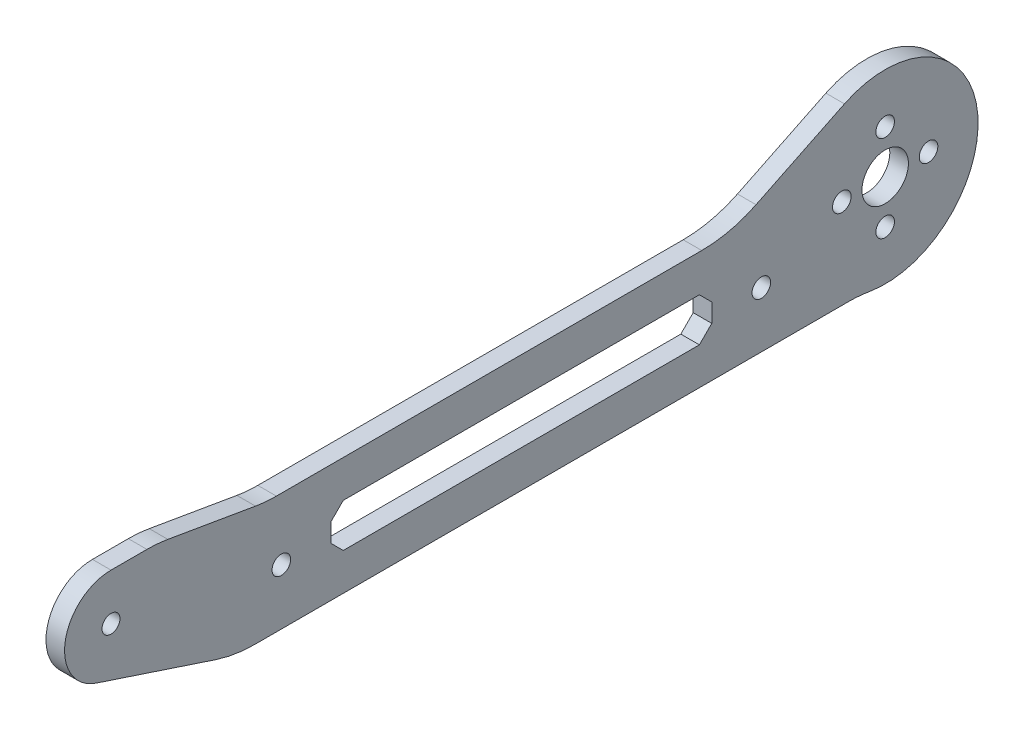
ISO-10303-21;
HEADER;
FILE_DESCRIPTION(('STEP AP214'),'2;1');
FILE_NAME('part.step','',(''),(''),'','','');
FILE_SCHEMA(('AUTOMOTIVE_DESIGN { 1 0 10303 214 1 1 1 1 }'));
ENDSEC;
DATA;
#1=APPLICATION_CONTEXT('core data for automotive mechanical design processes');
#2=APPLICATION_PROTOCOL_DEFINITION('international standard','automotive_design',2000,#1);
#3=PRODUCT_CONTEXT('',#1,'mechanical');
#4=PRODUCT('Part','Part','',(#3));
#5=PRODUCT_RELATED_PRODUCT_CATEGORY('part','',(#4));
#6=PRODUCT_DEFINITION_FORMATION('','',#4);
#7=PRODUCT_DEFINITION_CONTEXT('part definition',#1,'design');
#8=PRODUCT_DEFINITION('design','',#6,#7);
#9=PRODUCT_DEFINITION_SHAPE('','',#8);
#10=(LENGTH_UNIT() NAMED_UNIT(*) SI_UNIT(.MILLI.,.METRE.));
#11=(NAMED_UNIT(*) PLANE_ANGLE_UNIT() SI_UNIT($,.RADIAN.));
#12=(NAMED_UNIT(*) SI_UNIT($,.STERADIAN.) SOLID_ANGLE_UNIT());
#13=UNCERTAINTY_MEASURE_WITH_UNIT(LENGTH_MEASURE(1.E-05),#10,'distance_accuracy_value','');
#14=(GEOMETRIC_REPRESENTATION_CONTEXT(3) GLOBAL_UNCERTAINTY_ASSIGNED_CONTEXT((#13)) GLOBAL_UNIT_ASSIGNED_CONTEXT((#10,
#11,#12)) REPRESENTATION_CONTEXT('',''));
#15=CARTESIAN_POINT('',(0.,0.,0.));
#16=DIRECTION('',(0.,0.,1.));
#17=DIRECTION('',(1.,0.,0.));
#18=AXIS2_PLACEMENT_3D('',#15,#16,#17);
#19=CARTESIAN_POINT('',(1.5,10.75,10.75));
#20=DIRECTION('',(0.,0.707106781186548,0.707106781186547));
#21=DIRECTION('',(0.,-0.707106781186547,0.707106781186548));
#22=AXIS2_PLACEMENT_3D('',#19,#20,#21);
#23=PLANE('',#22);
#24=DIRECTION('',(0.,0.707106781186547,-0.707106781186548));
#25=VECTOR('',#24,1.);
#26=CARTESIAN_POINT('',(-1.5,10.75,10.75));
#27=LINE('',#26,#25);
#28=CARTESIAN_POINT('',(-1.5,-8.50000000000001,30.));
#29=VERTEX_POINT('',#28);
#30=CARTESIAN_POINT('',(-1.5,-6.50000000000001,28.));
#31=VERTEX_POINT('',#30);
#32=EDGE_CURVE('E350',#29,#31,#27,.T.);
#33=ORIENTED_EDGE('',*,*,#32,.F.);
#34=DIRECTION('',(-1.,0.,0.));
#35=VECTOR('',#34,1.);
#36=CARTESIAN_POINT('',(1.5,-8.50000000000001,30.));
#37=LINE('',#36,#35);
#38=CARTESIAN_POINT('',(1.5,-8.50000000000001,30.));
#39=VERTEX_POINT('',#38);
#40=EDGE_CURVE('E217',#39,#29,#37,.T.);
#41=ORIENTED_EDGE('',*,*,#40,.F.);
#42=DIRECTION('',(0.,0.707106781186547,-0.707106781186548));
#43=VECTOR('',#42,1.);
#44=CARTESIAN_POINT('',(1.5,10.75,10.75));
#45=LINE('',#44,#43);
#46=CARTESIAN_POINT('',(1.5,-6.50000000000001,28.));
#47=VERTEX_POINT('',#46);
#48=EDGE_CURVE('E288',#39,#47,#45,.T.);
#49=ORIENTED_EDGE('',*,*,#48,.T.);
#50=DIRECTION('',(-1.,0.,0.));
#51=VECTOR('',#50,1.);
#52=CARTESIAN_POINT('',(1.5,-6.50000000000001,28.));
#53=LINE('',#52,#51);
#54=EDGE_CURVE('E205',#47,#31,#53,.T.);
#55=ORIENTED_EDGE('',*,*,#54,.T.);
#56=EDGE_LOOP('',(#33,#41,#49,#55));
#57=FACE_BOUND('',#56,.T.);
#58=ADVANCED_FACE('F35',(#57),#23,.T.);
#59=CARTESIAN_POINT('',(1.5,-8.50000000000001,0.));
#60=DIRECTION('',(0.,1.,0.));
#61=DIRECTION('',(0.,0.,1.));
#62=AXIS2_PLACEMENT_3D('',#59,#60,#61);
#63=PLANE('',#62);
#64=DIRECTION('',(0.,0.,-1.));
#65=VECTOR('',#64,1.);
#66=CARTESIAN_POINT('',(-1.5,-8.50000000000001,0.));
#67=LINE('',#66,#65);
#68=CARTESIAN_POINT('',(-1.5,-8.50000000000001,87.5));
#69=VERTEX_POINT('',#68);
#70=EDGE_CURVE('E353',#69,#29,#67,.T.);
#71=ORIENTED_EDGE('',*,*,#70,.F.);
#72=DIRECTION('',(-1.,0.,0.));
#73=VECTOR('',#72,1.);
#74=CARTESIAN_POINT('',(1.5,-8.50000000000001,87.5));
#75=LINE('',#74,#73);
#76=CARTESIAN_POINT('',(1.5,-8.50000000000001,87.5));
#77=VERTEX_POINT('',#76);
#78=EDGE_CURVE('E390',#77,#69,#75,.T.);
#79=ORIENTED_EDGE('',*,*,#78,.F.);
#80=DIRECTION('',(0.,0.,-1.));
#81=VECTOR('',#80,1.);
#82=CARTESIAN_POINT('',(1.5,-8.50000000000001,0.));
#83=LINE('',#82,#81);
#84=EDGE_CURVE('E291',#77,#39,#83,.T.);
#85=ORIENTED_EDGE('',*,*,#84,.T.);
#86=ORIENTED_EDGE('',*,*,#40,.T.);
#87=EDGE_LOOP('',(#71,#79,#85,#86));
#88=FACE_BOUND('',#87,.T.);
#89=ADVANCED_FACE('F435',(#88),#63,.T.);
#90=CARTESIAN_POINT('',(1.5,-48.,48.));
#91=DIRECTION('',(0.,0.707106781186548,-0.707106781186547));
#92=DIRECTION('',(0.,0.707106781186547,0.707106781186548));
#93=AXIS2_PLACEMENT_3D('',#90,#91,#92);
#94=PLANE('',#93);
#95=DIRECTION('',(0.,-0.707106781186547,-0.707106781186548));
#96=VECTOR('',#95,1.);
#97=CARTESIAN_POINT('',(-1.5,-48.,48.));
#98=LINE('',#97,#96);
#99=CARTESIAN_POINT('',(-1.5,-6.50000000000001,89.5));
#100=VERTEX_POINT('',#99);
#101=EDGE_CURVE('E356',#100,#69,#98,.T.);
#102=ORIENTED_EDGE('',*,*,#101,.F.);
#103=DIRECTION('',(-1.,0.,0.));
#104=VECTOR('',#103,1.);
#105=CARTESIAN_POINT('',(1.5,-6.50000000000001,89.5));
#106=LINE('',#105,#104);
#107=CARTESIAN_POINT('',(1.5,-6.50000000000001,89.5));
#108=VERTEX_POINT('',#107);
#109=EDGE_CURVE('E388',#108,#100,#106,.T.);
#110=ORIENTED_EDGE('',*,*,#109,.F.);
#111=DIRECTION('',(0.,-0.707106781186547,-0.707106781186548));
#112=VECTOR('',#111,1.);
#113=CARTESIAN_POINT('',(1.5,-48.,48.));
#114=LINE('',#113,#112);
#115=EDGE_CURVE('E294',#108,#77,#114,.T.);
#116=ORIENTED_EDGE('',*,*,#115,.T.);
#117=ORIENTED_EDGE('',*,*,#78,.T.);
#118=EDGE_LOOP('',(#102,#110,#116,#117));
#119=FACE_BOUND('',#118,.T.);
#120=ADVANCED_FACE('F441',(#119),#94,.T.);
#121=CARTESIAN_POINT('',(1.5,0.,89.5));
#122=DIRECTION('',(0.,0.,-1.));
#123=DIRECTION('',(-1.,0.,0.));
#124=AXIS2_PLACEMENT_3D('',#121,#122,#123);
#125=PLANE('',#124);
#126=DIRECTION('',(0.,-1.,0.));
#127=VECTOR('',#126,1.);
#128=CARTESIAN_POINT('',(-1.5,0.,89.5));
#129=LINE('',#128,#127);
#130=CARTESIAN_POINT('',(-1.5,-3.50000000000001,89.5));
#131=VERTEX_POINT('',#130);
#132=EDGE_CURVE('E359',#131,#100,#129,.T.);
#133=ORIENTED_EDGE('',*,*,#132,.F.);
#134=DIRECTION('',(-1.,0.,0.));
#135=VECTOR('',#134,1.);
#136=CARTESIAN_POINT('',(1.5,-3.50000000000001,89.5));
#137=LINE('',#136,#135);
#138=CARTESIAN_POINT('',(1.5,-3.50000000000001,89.5));
#139=VERTEX_POINT('',#138);
#140=EDGE_CURVE('E386',#139,#131,#137,.T.);
#141=ORIENTED_EDGE('',*,*,#140,.F.);
#142=DIRECTION('',(0.,-1.,0.));
#143=VECTOR('',#142,1.);
#144=CARTESIAN_POINT('',(1.5,0.,89.5));
#145=LINE('',#144,#143);
#146=EDGE_CURVE('E297',#139,#108,#145,.T.);
#147=ORIENTED_EDGE('',*,*,#146,.T.);
#148=ORIENTED_EDGE('',*,*,#109,.T.);
#149=EDGE_LOOP('',(#133,#141,#147,#148));
#150=FACE_BOUND('',#149,.T.);
#151=ADVANCED_FACE('F547',(#150),#125,.T.);
#152=CARTESIAN_POINT('',(1.5,43.,43.));
#153=DIRECTION('',(0.,0.707106781186548,0.707106781186547));
#154=DIRECTION('',(0.,-0.707106781186547,0.707106781186548));
#155=AXIS2_PLACEMENT_3D('',#152,#153,#154);
#156=PLANE('',#155);
#157=DIRECTION('',(0.,0.707106781186547,-0.707106781186548));
#158=VECTOR('',#157,1.);
#159=CARTESIAN_POINT('',(-1.5,43.,43.));
#160=LINE('',#159,#158);
#161=CARTESIAN_POINT('',(-1.5,-1.50000000000001,87.5));
#162=VERTEX_POINT('',#161);
#163=EDGE_CURVE('E362',#131,#162,#160,.T.);
#164=ORIENTED_EDGE('',*,*,#163,.T.);
#165=DIRECTION('',(-1.,0.,0.));
#166=VECTOR('',#165,1.);
#167=CARTESIAN_POINT('',(1.5,-1.50000000000001,87.5));
#168=LINE('',#167,#166);
#169=CARTESIAN_POINT('',(1.5,-1.50000000000001,87.5));
#170=VERTEX_POINT('',#169);
#171=EDGE_CURVE('E383',#170,#162,#168,.T.);
#172=ORIENTED_EDGE('',*,*,#171,.F.);
#173=DIRECTION('',(0.,0.707106781186547,-0.707106781186548));
#174=VECTOR('',#173,1.);
#175=CARTESIAN_POINT('',(1.5,43.,43.));
#176=LINE('',#175,#174);
#177=EDGE_CURVE('E300',#139,#170,#176,.T.);
#178=ORIENTED_EDGE('',*,*,#177,.F.);
#179=ORIENTED_EDGE('',*,*,#140,.T.);
#180=EDGE_LOOP('',(#164,#172,#178,#179));
#181=FACE_BOUND('',#180,.T.);
#182=ADVANCED_FACE('F543',(#181),#156,.F.);
#183=CARTESIAN_POINT('',(1.5,-1.50000000000001,0.));
#184=DIRECTION('',(0.,1.,0.));
#185=DIRECTION('',(0.,0.,1.));
#186=AXIS2_PLACEMENT_3D('',#183,#184,#185);
#187=PLANE('',#186);
#188=DIRECTION('',(0.,0.,-1.));
#189=VECTOR('',#188,1.);
#190=CARTESIAN_POINT('',(-1.5,-1.50000000000001,0.));
#191=LINE('',#190,#189);
#192=CARTESIAN_POINT('',(-1.5,-1.50000000000001,30.));
#193=VERTEX_POINT('',#192);
#194=EDGE_CURVE('E365',#162,#193,#191,.T.);
#195=ORIENTED_EDGE('',*,*,#194,.T.);
#196=DIRECTION('',(-1.,0.,0.));
#197=VECTOR('',#196,1.);
#198=CARTESIAN_POINT('',(1.5,-1.50000000000001,30.));
#199=LINE('',#198,#197);
#200=CARTESIAN_POINT('',(1.5,-1.50000000000001,30.));
#201=VERTEX_POINT('',#200);
#202=EDGE_CURVE('E380',#201,#193,#199,.T.);
#203=ORIENTED_EDGE('',*,*,#202,.F.);
#204=DIRECTION('',(0.,0.,-1.));
#205=VECTOR('',#204,1.);
#206=CARTESIAN_POINT('',(1.5,-1.50000000000001,0.));
#207=LINE('',#206,#205);
#208=EDGE_CURVE('E303',#170,#201,#207,.T.);
#209=ORIENTED_EDGE('',*,*,#208,.F.);
#210=ORIENTED_EDGE('',*,*,#171,.T.);
#211=EDGE_LOOP('',(#195,#203,#209,#210));
#212=FACE_BOUND('',#211,.T.);
#213=ADVANCED_FACE('F539',(#212),#187,.F.);
#214=CARTESIAN_POINT('',(1.5,-15.75,15.75));
#215=DIRECTION('',(0.,0.707106781186548,-0.707106781186547));
#216=DIRECTION('',(0.,0.707106781186547,0.707106781186548));
#217=AXIS2_PLACEMENT_3D('',#214,#215,#216);
#218=PLANE('',#217);
#219=DIRECTION('',(0.,-0.707106781186547,-0.707106781186548));
#220=VECTOR('',#219,1.);
#221=CARTESIAN_POINT('',(-1.5,-15.75,15.75));
#222=LINE('',#221,#220);
#223=CARTESIAN_POINT('',(-1.5,-3.50000000000001,28.));
#224=VERTEX_POINT('',#223);
#225=EDGE_CURVE('E368',#193,#224,#222,.T.);
#226=ORIENTED_EDGE('',*,*,#225,.T.);
#227=DIRECTION('',(-1.,0.,0.));
#228=VECTOR('',#227,1.);
#229=CARTESIAN_POINT('',(1.5,-3.50000000000001,28.));
#230=LINE('',#229,#228);
#231=CARTESIAN_POINT('',(1.5,-3.50000000000001,28.));
#232=VERTEX_POINT('',#231);
#233=EDGE_CURVE('E208',#232,#224,#230,.T.);
#234=ORIENTED_EDGE('',*,*,#233,.F.);
#235=DIRECTION('',(0.,-0.707106781186547,-0.707106781186548));
#236=VECTOR('',#235,1.);
#237=CARTESIAN_POINT('',(1.5,-15.75,15.75));
#238=LINE('',#237,#236);
#239=EDGE_CURVE('E306',#201,#232,#238,.T.);
#240=ORIENTED_EDGE('',*,*,#239,.F.);
#241=ORIENTED_EDGE('',*,*,#202,.T.);
#242=EDGE_LOOP('',(#226,#234,#240,#241));
#243=FACE_BOUND('',#242,.T.);
#244=ADVANCED_FACE('F473',(#243),#218,.F.);
#245=CARTESIAN_POINT('',(1.5,0.,0.));
#246=DIRECTION('',(-1.,0.,0.));
#247=DIRECTION('',(0.,0.,1.));
#248=AXIS2_PLACEMENT_3D('',#245,#246,#247);
#249=CYLINDRICAL_SURFACE('',#248,15.);
#250=CARTESIAN_POINT('',(1.5,0.,0.));
#251=DIRECTION('',(1.,0.,0.));
#252=DIRECTION('',(0.,0.,-1.));
#253=AXIS2_PLACEMENT_3D('',#250,#251,#252);
#254=CIRCLE('',#253,15.);
#255=CARTESIAN_POINT('',(1.5,-14.7857142857143,2.52639131197534));
#256=VERTEX_POINT('',#255);
#257=CARTESIAN_POINT('',(1.5,13.4831460674157,6.57303370786517));
#258=VERTEX_POINT('',#257);
#259=EDGE_CURVE('E187',#256,#258,#254,.T.);
#260=ORIENTED_EDGE('',*,*,#259,.F.);
#261=DIRECTION('',(-1.,0.,0.));
#262=VECTOR('',#261,1.);
#263=CARTESIAN_POINT('',(1.5,-14.7857142857143,2.52639131197534));
#264=LINE('',#263,#262);
#265=CARTESIAN_POINT('',(-1.5,-14.7857142857143,2.52639131197534));
#266=VERTEX_POINT('',#265);
#267=EDGE_CURVE('E214',#256,#266,#264,.T.);
#268=ORIENTED_EDGE('',*,*,#267,.T.);
#269=CARTESIAN_POINT('',(-1.5,0.,0.));
#270=DIRECTION('',(1.,0.,0.));
#271=DIRECTION('',(0.,0.,-1.));
#272=AXIS2_PLACEMENT_3D('',#269,#270,#271);
#273=CIRCLE('',#272,15.);
#274=CARTESIAN_POINT('',(-1.5,13.4831460674157,6.57303370786517));
#275=VERTEX_POINT('',#274);
#276=EDGE_CURVE('E204',#266,#275,#273,.T.);
#277=ORIENTED_EDGE('',*,*,#276,.T.);
#278=DIRECTION('',(-1.,0.,0.));
#279=VECTOR('',#278,1.);
#280=CARTESIAN_POINT('',(1.5,13.4831460674157,6.57303370786517));
#281=LINE('',#280,#279);
#282=EDGE_CURVE('E183',#258,#275,#281,.T.);
#283=ORIENTED_EDGE('',*,*,#282,.F.);
#284=EDGE_LOOP('',(#260,#268,#277,#283));
#285=FACE_BOUND('',#284,.T.);
#286=ADVANCED_FACE('F202',(#285),#249,.T.);
#287=CARTESIAN_POINT('',(1.5,13.4831460674157,6.57303370786516));
#288=DIRECTION('',(0.,0.898876404494382,0.438202247191011));
#289=DIRECTION('',(0.,-0.438202247191011,0.898876404494382));
#290=AXIS2_PLACEMENT_3D('',#287,#288,#289);
#291=PLANE('',#290);
#292=DIRECTION('',(0.,0.438202247191011,-0.898876404494382));
#293=VECTOR('',#292,1.);
#294=CARTESIAN_POINT('',(-1.5,13.4831460674157,6.57303370786516));
#295=LINE('',#294,#293);
#296=CARTESIAN_POINT('',(-1.5,6.52247191011237,20.8513396715644));
#297=VERTEX_POINT('',#296);
#298=EDGE_CURVE('E256',#297,#275,#295,.T.);
#299=ORIENTED_EDGE('',*,*,#298,.F.);
#300=DIRECTION('',(-1.,0.,0.));
#301=VECTOR('',#300,1.);
#302=CARTESIAN_POINT('',(1.5,6.52247191011237,20.8513396715644));
#303=LINE('',#302,#301);
#304=CARTESIAN_POINT('',(1.5,6.52247191011237,20.8513396715644));
#305=VERTEX_POINT('',#304);
#306=EDGE_CURVE('E185',#297,#305,#303,.F.);
#307=ORIENTED_EDGE('',*,*,#306,.T.);
#308=DIRECTION('',(0.,0.438202247191011,-0.898876404494382));
#309=VECTOR('',#308,1.);
#310=CARTESIAN_POINT('',(1.5,13.4831460674157,6.57303370786516));
#311=LINE('',#310,#309);
#312=EDGE_CURVE('E178',#305,#258,#311,.T.);
#313=ORIENTED_EDGE('',*,*,#312,.T.);
#314=ORIENTED_EDGE('',*,*,#282,.T.);
#315=EDGE_LOOP('',(#299,#307,#313,#314));
#316=FACE_BOUND('',#315,.T.);
#317=ADVANCED_FACE('F181',(#316),#291,.T.);
#318=CARTESIAN_POINT('',(1.5,4.50000000000002,0.));
#319=DIRECTION('',(0.,1.,0.));
#320=DIRECTION('',(0.,0.,1.));
#321=AXIS2_PLACEMENT_3D('',#318,#319,#320);
#322=PLANE('',#321);
#323=DIRECTION('',(0.,0.,-1.));
#324=VECTOR('',#323,1.);
#325=CARTESIAN_POINT('',(-1.5,4.50000000000002,0.));
#326=LINE('',#325,#324);
#327=CARTESIAN_POINT('',(-1.5,4.5,98.298127302902));
#328=VERTEX_POINT('',#327);
#329=CARTESIAN_POINT('',(-1.5,4.50000000000001,29.6153846153846));
#330=VERTEX_POINT('',#329);
#331=EDGE_CURVE('E258',#328,#330,#326,.T.);
#332=ORIENTED_EDGE('',*,*,#331,.F.);
#333=DIRECTION('',(-1.,0.,0.));
#334=VECTOR('',#333,1.);
#335=CARTESIAN_POINT('',(1.5,4.5,98.298127302902));
#336=LINE('',#335,#334);
#337=CARTESIAN_POINT('',(1.5,4.5,98.298127302902));
#338=VERTEX_POINT('',#337);
#339=EDGE_CURVE('E241',#328,#338,#336,.F.);
#340=ORIENTED_EDGE('',*,*,#339,.T.);
#341=DIRECTION('',(0.,0.,-1.));
#342=VECTOR('',#341,1.);
#343=CARTESIAN_POINT('',(1.5,4.50000000000002,0.));
#344=LINE('',#343,#342);
#345=CARTESIAN_POINT('',(1.5,4.50000000000001,29.6153846153846));
#346=VERTEX_POINT('',#345);
#347=EDGE_CURVE('E186',#338,#346,#344,.T.);
#348=ORIENTED_EDGE('',*,*,#347,.T.);
#349=DIRECTION('',(-1.,0.,0.));
#350=VECTOR('',#349,1.);
#351=CARTESIAN_POINT('',(-1.5,4.50000000000001,29.6153846153846));
#352=LINE('',#351,#350);
#353=EDGE_CURVE('E238',#346,#330,#352,.T.);
#354=ORIENTED_EDGE('',*,*,#353,.T.);
#355=EDGE_LOOP('',(#332,#340,#348,#354));
#356=FACE_BOUND('',#355,.T.);
#357=ADVANCED_FACE('F264',(#356),#322,.T.);
#358=CARTESIAN_POINT('',(1.5,-12.281919111816,2.10547184773989));
#359=DIRECTION('',(0.,0.985622254813267,-0.168963815110846));
#360=DIRECTION('',(0.,0.168963815110846,0.985622254813267));
#361=AXIS2_PLACEMENT_3D('',#358,#359,#360);
#362=PLANE('',#361);
#363=DIRECTION('',(0.,-0.168963815110846,-0.985622254813267));
#364=VECTOR('',#363,1.);
#365=CARTESIAN_POINT('',(-1.5,-12.281919111816,2.10547184773989));
#366=LINE('',#365,#364);
#367=CARTESIAN_POINT('',(-1.5,7.21244509626535,115.822596394881));
#368=VERTEX_POINT('',#367);
#369=CARTESIAN_POINT('',(-1.5,4.78755490373467,101.677403605119));
#370=VERTEX_POINT('',#369);
#371=EDGE_CURVE('E331',#368,#370,#366,.T.);
#372=ORIENTED_EDGE('',*,*,#371,.F.);
#373=DIRECTION('',(-1.,0.,0.));
#374=VECTOR('',#373,1.);
#375=CARTESIAN_POINT('',(1.5,7.21244509626533,115.822596394881));
#376=LINE('',#375,#374);
#377=CARTESIAN_POINT('',(1.5,7.21244509626535,115.822596394881));
#378=VERTEX_POINT('',#377);
#379=EDGE_CURVE('E232',#368,#378,#376,.F.);
#380=ORIENTED_EDGE('',*,*,#379,.T.);
#381=DIRECTION('',(0.,-0.168963815110846,-0.985622254813267));
#382=VECTOR('',#381,1.);
#383=CARTESIAN_POINT('',(1.5,-12.281919111816,2.10547184773989));
#384=LINE('',#383,#382);
#385=CARTESIAN_POINT('',(1.5,4.78755490373467,101.677403605119));
#386=VERTEX_POINT('',#385);
#387=EDGE_CURVE('E267',#378,#386,#384,.T.);
#388=ORIENTED_EDGE('',*,*,#387,.T.);
#389=DIRECTION('',(-1.,0.,0.));
#390=VECTOR('',#389,1.);
#391=CARTESIAN_POINT('',(-1.5,4.78755490373467,101.677403605119));
#392=LINE('',#391,#390);
#393=EDGE_CURVE('E229',#386,#370,#392,.T.);
#394=ORIENTED_EDGE('',*,*,#393,.T.);
#395=EDGE_LOOP('',(#372,#380,#388,#394));
#396=FACE_BOUND('',#395,.T.);
#397=ADVANCED_FACE('F410',(#396),#362,.T.);
#398=CARTESIAN_POINT('',(1.5,7.4999999999998,0.));
#399=DIRECTION('',(0.,1.,0.));
#400=DIRECTION('',(0.,0.,1.));
#401=AXIS2_PLACEMENT_3D('',#398,#399,#400);
#402=PLANE('',#401);
#403=DIRECTION('',(0.,0.,-1.));
#404=VECTOR('',#403,1.);
#405=CARTESIAN_POINT('',(1.5,7.4999999999998,0.));
#406=LINE('',#405,#404);
#407=CARTESIAN_POINT('',(1.5,7.50000000000001,125.));
#408=VERTEX_POINT('',#407);
#409=CARTESIAN_POINT('',(1.5,7.5,119.201872697098));
#410=VERTEX_POINT('',#409);
#411=EDGE_CURVE('E270',#408,#410,#406,.T.);
#412=ORIENTED_EDGE('',*,*,#411,.T.);
#413=DIRECTION('',(-1.,0.,0.));
#414=VECTOR('',#413,1.);
#415=CARTESIAN_POINT('',(1.5,7.5,119.201872697098));
#416=LINE('',#415,#414);
#417=CARTESIAN_POINT('',(-1.5,7.5,119.201872697098));
#418=VERTEX_POINT('',#417);
#419=EDGE_CURVE('E222',#410,#418,#416,.T.);
#420=ORIENTED_EDGE('',*,*,#419,.T.);
#421=DIRECTION('',(0.,0.,-1.));
#422=VECTOR('',#421,1.);
#423=CARTESIAN_POINT('',(-1.5,7.4999999999998,0.));
#424=LINE('',#423,#422);
#425=CARTESIAN_POINT('',(-1.5,7.50000000000001,125.));
#426=VERTEX_POINT('',#425);
#427=EDGE_CURVE('E334',#426,#418,#424,.T.);
#428=ORIENTED_EDGE('',*,*,#427,.F.);
#429=DIRECTION('',(-1.,0.,0.));
#430=VECTOR('',#429,1.);
#431=CARTESIAN_POINT('',(1.5,7.50000000000001,125.));
#432=LINE('',#431,#430);
#433=EDGE_CURVE('E206',#408,#426,#432,.T.);
#434=ORIENTED_EDGE('',*,*,#433,.F.);
#435=EDGE_LOOP('',(#412,#420,#428,#434));
#436=FACE_BOUND('',#435,.T.);
#437=ADVANCED_FACE('F401',(#436),#402,.T.);
#438=CARTESIAN_POINT('',(1.5,0.,125.));
#439=DIRECTION('',(-1.,0.,0.));
#440=DIRECTION('',(0.,0.,1.));
#441=AXIS2_PLACEMENT_3D('',#438,#439,#440);
#442=CYLINDRICAL_SURFACE('',#441,7.50000000000001);
#443=CARTESIAN_POINT('',(-1.5,0.,125.));
#444=DIRECTION('',(1.,0.,0.));
#445=DIRECTION('',(0.,0.,-1.));
#446=AXIS2_PLACEMENT_3D('',#443,#444,#445);
#447=CIRCLE('',#446,7.50000000000001);
#448=CARTESIAN_POINT('',(-1.5,-7.12200850271521,127.350956164469));
#449=VERTEX_POINT('',#448);
#450=EDGE_CURVE('E336',#426,#449,#447,.T.);
#451=ORIENTED_EDGE('',*,*,#450,.T.);
#452=DIRECTION('',(-1.,0.,0.));
#453=VECTOR('',#452,1.);
#454=CARTESIAN_POINT('',(1.5,-7.12200850271521,127.350956164469));
#455=LINE('',#454,#453);
#456=CARTESIAN_POINT('',(1.5,-7.12200850271521,127.350956164469));
#457=VERTEX_POINT('',#456);
#458=EDGE_CURVE('E210',#457,#449,#455,.T.);
#459=ORIENTED_EDGE('',*,*,#458,.F.);
#460=CARTESIAN_POINT('',(1.5,0.,125.));
#461=DIRECTION('',(1.,0.,0.));
#462=DIRECTION('',(0.,0.,-1.));
#463=AXIS2_PLACEMENT_3D('',#460,#461,#462);
#464=CIRCLE('',#463,7.50000000000001);
#465=EDGE_CURVE('E275',#408,#457,#464,.T.);
#466=ORIENTED_EDGE('',*,*,#465,.F.);
#467=ORIENTED_EDGE('',*,*,#433,.T.);
#468=EDGE_LOOP('',(#451,#459,#466,#467));
#469=FACE_BOUND('',#468,.T.);
#470=ADVANCED_FACE('F398',(#469),#442,.T.);
#471=CARTESIAN_POINT('',(1.5,-44.3298524868385,14.6331670250297));
#472=DIRECTION('',(0.,-0.949601133695359,0.313460821929136));
#473=DIRECTION('',(0.,-0.313460821929136,-0.949601133695359));
#474=AXIS2_PLACEMENT_3D('',#471,#472,#473);
#475=PLANE('',#474);
#476=DIRECTION('',(0.,0.313460821929136,0.949601133695359));
#477=VECTOR('',#476,1.);
#478=CARTESIAN_POINT('',(-1.5,-44.3298524868385,14.6331670250297));
#479=LINE('',#478,#477);
#480=CARTESIAN_POINT('',(-1.5,-13.4920226739072,108.05357590051));
#481=VERTEX_POINT('',#480);
#482=EDGE_CURVE('E339',#481,#449,#479,.T.);
#483=ORIENTED_EDGE('',*,*,#482,.F.);
#484=DIRECTION('',(-1.,0.,0.));
#485=VECTOR('',#484,1.);
#486=CARTESIAN_POINT('',(1.5,-13.4920226739072,108.05357590051));
#487=LINE('',#486,#485);
#488=CARTESIAN_POINT('',(1.5,-13.4920226739072,108.05357590051));
#489=VERTEX_POINT('',#488);
#490=EDGE_CURVE('E50',#481,#489,#487,.F.);
#491=ORIENTED_EDGE('',*,*,#490,.T.);
#492=DIRECTION('',(0.,0.313460821929136,0.949601133695359));
#493=VECTOR('',#492,1.);
#494=CARTESIAN_POINT('',(1.5,-44.3298524868385,14.6331670250297));
#495=LINE('',#494,#493);
#496=EDGE_CURVE('E278',#489,#457,#495,.T.);
#497=ORIENTED_EDGE('',*,*,#496,.T.);
#498=ORIENTED_EDGE('',*,*,#458,.T.);
#499=EDGE_LOOP('',(#483,#491,#497,#498));
#500=FACE_BOUND('',#499,.T.);
#501=ADVANCED_FACE('F394',(#500),#475,.T.);
#502=CARTESIAN_POINT('',(1.5,0.,28.));
#503=DIRECTION('',(0.,0.,-1.));
#504=DIRECTION('',(-1.,0.,0.));
#505=AXIS2_PLACEMENT_3D('',#502,#503,#504);
#506=PLANE('',#505);
#507=DIRECTION('',(0.,-1.,0.));
#508=VECTOR('',#507,1.);
#509=CARTESIAN_POINT('',(-1.5,0.,28.));
#510=LINE('',#509,#508);
#511=EDGE_CURVE('E371',#224,#31,#510,.T.);
#512=ORIENTED_EDGE('',*,*,#511,.T.);
#513=ORIENTED_EDGE('',*,*,#54,.F.);
#514=DIRECTION('',(0.,-1.,0.));
#515=VECTOR('',#514,1.);
#516=CARTESIAN_POINT('',(1.5,0.,28.));
#517=LINE('',#516,#515);
#518=EDGE_CURVE('E309',#232,#47,#517,.T.);
#519=ORIENTED_EDGE('',*,*,#518,.F.);
#520=ORIENTED_EDGE('',*,*,#233,.T.);
#521=EDGE_LOOP('',(#512,#513,#519,#520));
#522=FACE_BOUND('',#521,.T.);
#523=ADVANCED_FACE('F451',(#522),#506,.F.);
#524=CARTESIAN_POINT('',(1.5,-5.50000000000001,97.5));
#525=DIRECTION('',(-1.,0.,0.));
#526=DIRECTION('',(0.,0.,1.));
#527=AXIS2_PLACEMENT_3D('',#524,#525,#526);
#528=CYLINDRICAL_SURFACE('',#527,1.5);
#529=CARTESIAN_POINT('',(1.5,-5.50000000000001,97.5));
#530=DIRECTION('',(1.,0.,0.));
#531=DIRECTION('',(0.,0.,-1.));
#532=AXIS2_PLACEMENT_3D('',#529,#530,#531);
#533=CIRCLE('',#532,1.5);
#534=CARTESIAN_POINT('',(1.5,-5.50000000000001,96.));
#535=VERTEX_POINT('',#534);
#536=EDGE_CURVE('E285',#535,#535,#533,.T.);
#537=ORIENTED_EDGE('',*,*,#536,.T.);
#538=EDGE_LOOP('',(#537));
#539=FACE_BOUND('',#538,.T.);
#540=CARTESIAN_POINT('',(-1.5,-5.50000000000001,97.5));
#541=DIRECTION('',(1.,0.,0.));
#542=DIRECTION('',(0.,0.,-1.));
#543=AXIS2_PLACEMENT_3D('',#540,#541,#542);
#544=CIRCLE('',#543,1.5);
#545=CARTESIAN_POINT('',(-1.5,-5.50000000000001,96.));
#546=VERTEX_POINT('',#545);
#547=EDGE_CURVE('E347',#546,#546,#544,.T.);
#548=ORIENTED_EDGE('',*,*,#547,.F.);
#549=EDGE_LOOP('',(#548));
#550=FACE_BOUND('',#549,.T.);
#551=ADVANCED_FACE('F447',(#539,#550),#528,.F.);
#552=CARTESIAN_POINT('',(1.5,-5.5,20.));
#553=DIRECTION('',(-1.,0.,0.));
#554=DIRECTION('',(0.,0.,1.));
#555=AXIS2_PLACEMENT_3D('',#552,#553,#554);
#556=CYLINDRICAL_SURFACE('',#555,1.5);
#557=CARTESIAN_POINT('',(1.5,-5.5,20.));
#558=DIRECTION('',(1.,0.,0.));
#559=DIRECTION('',(0.,0.,-1.));
#560=AXIS2_PLACEMENT_3D('',#557,#558,#559);
#561=CIRCLE('',#560,1.5);
#562=CARTESIAN_POINT('',(1.5,-5.5,18.5));
#563=VERTEX_POINT('',#562);
#564=EDGE_CURVE('E282',#563,#563,#561,.T.);
#565=ORIENTED_EDGE('',*,*,#564,.T.);
#566=EDGE_LOOP('',(#565));
#567=FACE_BOUND('',#566,.T.);
#568=CARTESIAN_POINT('',(-1.5,-5.5,20.));
#569=DIRECTION('',(1.,0.,0.));
#570=DIRECTION('',(0.,0.,-1.));
#571=AXIS2_PLACEMENT_3D('',#568,#569,#570);
#572=CIRCLE('',#571,1.5);
#573=CARTESIAN_POINT('',(-1.5,-5.5,18.5));
#574=VERTEX_POINT('',#573);
#575=EDGE_CURVE('E344',#574,#574,#572,.T.);
#576=ORIENTED_EDGE('',*,*,#575,.F.);
#577=EDGE_LOOP('',(#576));
#578=FACE_BOUND('',#577,.T.);
#579=ADVANCED_FACE('F450',(#567,#578),#556,.F.);
#580=CARTESIAN_POINT('',(1.5,-14.5,0.));
#581=DIRECTION('',(0.,1.,0.));
#582=DIRECTION('',(0.,0.,1.));
#583=AXIS2_PLACEMENT_3D('',#580,#581,#582);
#584=PLANE('',#583);
#585=DIRECTION('',(0.,0.,-1.));
#586=VECTOR('',#585,1.);
#587=CARTESIAN_POINT('',(-1.5,-14.5,0.));
#588=LINE('',#587,#586);
#589=CARTESIAN_POINT('',(-1.5,-14.5,101.784359461928));
#590=VERTEX_POINT('',#589);
#591=CARTESIAN_POINT('',(-1.5,-14.5,5.8949130612758));
#592=VERTEX_POINT('',#591);
#593=EDGE_CURVE('E341',#590,#592,#588,.T.);
#594=ORIENTED_EDGE('',*,*,#593,.T.);
#595=DIRECTION('',(1.,0.,0.));
#596=VECTOR('',#595,1.);
#597=CARTESIAN_POINT('',(1.5,-14.5,5.8949130612758));
#598=LINE('',#597,#596);
#599=CARTESIAN_POINT('',(1.5,-14.5,5.8949130612758));
#600=VERTEX_POINT('',#599);
#601=EDGE_CURVE('E220',#592,#600,#598,.T.);
#602=ORIENTED_EDGE('',*,*,#601,.T.);
#603=DIRECTION('',(0.,0.,-1.));
#604=VECTOR('',#603,1.);
#605=CARTESIAN_POINT('',(1.5,-14.5,0.));
#606=LINE('',#605,#604);
#607=CARTESIAN_POINT('',(1.5,-14.5,101.784359461928));
#608=VERTEX_POINT('',#607);
#609=EDGE_CURVE('E280',#608,#600,#606,.T.);
#610=ORIENTED_EDGE('',*,*,#609,.F.);
#611=DIRECTION('',(-1.,0.,0.));
#612=VECTOR('',#611,1.);
#613=CARTESIAN_POINT('',(-1.5,-14.5,101.784359461928));
#614=LINE('',#613,#612);
#615=EDGE_CURVE('E216',#608,#590,#614,.T.);
#616=ORIENTED_EDGE('',*,*,#615,.T.);
#617=EDGE_LOOP('',(#594,#602,#610,#616));
#618=FACE_BOUND('',#617,.T.);
#619=ADVANCED_FACE('F420',(#618),#584,.F.);
#620=CARTESIAN_POINT('',(1.5,7.,0.));
#621=DIRECTION('',(-1.,0.,0.));
#622=DIRECTION('',(0.,0.,1.));
#623=AXIS2_PLACEMENT_3D('',#620,#621,#622);
#624=CYLINDRICAL_SURFACE('',#623,1.5);
#625=CARTESIAN_POINT('',(1.5,7.,0.));
#626=DIRECTION('',(1.,0.,0.));
#627=DIRECTION('',(0.,0.,-1.));
#628=AXIS2_PLACEMENT_3D('',#625,#626,#627);
#629=CIRCLE('',#628,1.5);
#630=CARTESIAN_POINT('',(1.5,7.,-1.5));
#631=VERTEX_POINT('',#630);
#632=EDGE_CURVE('E199',#631,#631,#629,.T.);
#633=ORIENTED_EDGE('',*,*,#632,.T.);
#634=EDGE_LOOP('',(#633));
#635=FACE_BOUND('',#634,.T.);
#636=CARTESIAN_POINT('',(-1.5,7.,0.));
#637=DIRECTION('',(1.,0.,0.));
#638=DIRECTION('',(0.,0.,-1.));
#639=AXIS2_PLACEMENT_3D('',#636,#637,#638);
#640=CIRCLE('',#639,1.5);
#641=CARTESIAN_POINT('',(-1.5,7.,-1.5));
#642=VERTEX_POINT('',#641);
#643=EDGE_CURVE('E326',#642,#642,#640,.T.);
#644=ORIENTED_EDGE('',*,*,#643,.F.);
#645=EDGE_LOOP('',(#644));
#646=FACE_BOUND('',#645,.T.);
#647=ADVANCED_FACE('F458',(#635,#646),#624,.F.);
#648=CARTESIAN_POINT('',(1.5,-7.,0.));
#649=DIRECTION('',(-1.,0.,0.));
#650=DIRECTION('',(0.,0.,1.));
#651=AXIS2_PLACEMENT_3D('',#648,#649,#650);
#652=CYLINDRICAL_SURFACE('',#651,1.5);
#653=CARTESIAN_POINT('',(1.5,-7.,0.));
#654=DIRECTION('',(1.,0.,0.));
#655=DIRECTION('',(0.,0.,-1.));
#656=AXIS2_PLACEMENT_3D('',#653,#654,#655);
#657=CIRCLE('',#656,1.5);
#658=CARTESIAN_POINT('',(1.5,-7.,-1.5));
#659=VERTEX_POINT('',#658);
#660=EDGE_CURVE('E522',#659,#659,#657,.T.);
#661=ORIENTED_EDGE('',*,*,#660,.T.);
#662=EDGE_LOOP('',(#661));
#663=FACE_BOUND('',#662,.T.);
#664=CARTESIAN_POINT('',(-1.5,-7.,0.));
#665=DIRECTION('',(1.,0.,0.));
#666=DIRECTION('',(0.,0.,-1.));
#667=AXIS2_PLACEMENT_3D('',#664,#665,#666);
#668=CIRCLE('',#667,1.5);
#669=CARTESIAN_POINT('',(-1.5,-7.,-1.5));
#670=VERTEX_POINT('',#669);
#671=EDGE_CURVE('E323',#670,#670,#668,.T.);
#672=ORIENTED_EDGE('',*,*,#671,.F.);
#673=EDGE_LOOP('',(#672));
#674=FACE_BOUND('',#673,.T.);
#675=ADVANCED_FACE('F476',(#663,#674),#652,.F.);
#676=CARTESIAN_POINT('',(1.5,0.,-7.));
#677=DIRECTION('',(-1.,0.,0.));
#678=DIRECTION('',(0.,0.,1.));
#679=AXIS2_PLACEMENT_3D('',#676,#677,#678);
#680=CYLINDRICAL_SURFACE('',#679,1.5);
#681=CARTESIAN_POINT('',(1.5,0.,-7.));
#682=DIRECTION('',(1.,0.,0.));
#683=DIRECTION('',(0.,0.,-1.));
#684=AXIS2_PLACEMENT_3D('',#681,#682,#683);
#685=CIRCLE('',#684,1.5);
#686=CARTESIAN_POINT('',(1.5,0.,-8.5));
#687=VERTEX_POINT('',#686);
#688=EDGE_CURVE('E517',#687,#687,#685,.T.);
#689=ORIENTED_EDGE('',*,*,#688,.T.);
#690=EDGE_LOOP('',(#689));
#691=FACE_BOUND('',#690,.T.);
#692=CARTESIAN_POINT('',(-1.5,0.,-7.));
#693=DIRECTION('',(1.,0.,0.));
#694=DIRECTION('',(0.,0.,-1.));
#695=AXIS2_PLACEMENT_3D('',#692,#693,#694);
#696=CIRCLE('',#695,1.5);
#697=CARTESIAN_POINT('',(-1.5,0.,-8.5));
#698=VERTEX_POINT('',#697);
#699=EDGE_CURVE('E320',#698,#698,#696,.T.);
#700=ORIENTED_EDGE('',*,*,#699,.F.);
#701=EDGE_LOOP('',(#700));
#702=FACE_BOUND('',#701,.T.);
#703=ADVANCED_FACE('F480',(#691,#702),#680,.F.);
#704=CARTESIAN_POINT('',(1.5,0.,7.));
#705=DIRECTION('',(-1.,0.,0.));
#706=DIRECTION('',(0.,0.,1.));
#707=AXIS2_PLACEMENT_3D('',#704,#705,#706);
#708=CYLINDRICAL_SURFACE('',#707,1.5);
#709=CARTESIAN_POINT('',(1.5,0.,7.));
#710=DIRECTION('',(1.,0.,0.));
#711=DIRECTION('',(0.,0.,-1.));
#712=AXIS2_PLACEMENT_3D('',#709,#710,#711);
#713=CIRCLE('',#712,1.5);
#714=CARTESIAN_POINT('',(1.5,0.,5.5));
#715=VERTEX_POINT('',#714);
#716=EDGE_CURVE('E514',#715,#715,#713,.T.);
#717=ORIENTED_EDGE('',*,*,#716,.T.);
#718=EDGE_LOOP('',(#717));
#719=FACE_BOUND('',#718,.T.);
#720=CARTESIAN_POINT('',(-1.5,0.,7.));
#721=DIRECTION('',(1.,0.,0.));
#722=DIRECTION('',(0.,0.,-1.));
#723=AXIS2_PLACEMENT_3D('',#720,#721,#722);
#724=CIRCLE('',#723,1.5);
#725=CARTESIAN_POINT('',(-1.5,0.,5.5));
#726=VERTEX_POINT('',#725);
#727=EDGE_CURVE('E317',#726,#726,#724,.T.);
#728=ORIENTED_EDGE('',*,*,#727,.F.);
#729=EDGE_LOOP('',(#728));
#730=FACE_BOUND('',#729,.T.);
#731=ADVANCED_FACE('F484',(#719,#730),#708,.F.);
#732=CARTESIAN_POINT('',(1.5,0.,0.));
#733=DIRECTION('',(-1.,0.,0.));
#734=DIRECTION('',(0.,0.,1.));
#735=AXIS2_PLACEMENT_3D('',#732,#733,#734);
#736=CYLINDRICAL_SURFACE('',#735,3.75);
#737=CARTESIAN_POINT('',(1.5,0.,0.));
#738=DIRECTION('',(1.,0.,0.));
#739=DIRECTION('',(0.,0.,-1.));
#740=AXIS2_PLACEMENT_3D('',#737,#738,#739);
#741=CIRCLE('',#740,3.75);
#742=CARTESIAN_POINT('',(1.5,0.,-3.75));
#743=VERTEX_POINT('',#742);
#744=EDGE_CURVE('E376',#743,#743,#741,.T.);
#745=ORIENTED_EDGE('',*,*,#744,.T.);
#746=EDGE_LOOP('',(#745));
#747=FACE_BOUND('',#746,.T.);
#748=CARTESIAN_POINT('',(-1.5,0.,0.));
#749=DIRECTION('',(1.,0.,0.));
#750=DIRECTION('',(0.,0.,-1.));
#751=AXIS2_PLACEMENT_3D('',#748,#749,#750);
#752=CIRCLE('',#751,3.75);
#753=CARTESIAN_POINT('',(-1.5,0.,-3.75));
#754=VERTEX_POINT('',#753);
#755=EDGE_CURVE('E314',#754,#754,#752,.T.);
#756=ORIENTED_EDGE('',*,*,#755,.F.);
#757=EDGE_LOOP('',(#756));
#758=FACE_BOUND('',#757,.T.);
#759=ADVANCED_FACE('F487',(#747,#758),#736,.F.);
#760=CARTESIAN_POINT('',(1.5,0.,125.));
#761=DIRECTION('',(-1.,0.,0.));
#762=DIRECTION('',(0.,0.,1.));
#763=AXIS2_PLACEMENT_3D('',#760,#761,#762);
#764=CYLINDRICAL_SURFACE('',#763,1.45);
#765=CARTESIAN_POINT('',(1.5,0.,125.));
#766=DIRECTION('',(1.,0.,0.));
#767=DIRECTION('',(0.,0.,-1.));
#768=AXIS2_PLACEMENT_3D('',#765,#766,#767);
#769=CIRCLE('',#768,1.45);
#770=CARTESIAN_POINT('',(1.5,0.,123.55));
#771=VERTEX_POINT('',#770);
#772=EDGE_CURVE('E311',#771,#771,#769,.T.);
#773=ORIENTED_EDGE('',*,*,#772,.T.);
#774=EDGE_LOOP('',(#773));
#775=FACE_BOUND('',#774,.T.);
#776=CARTESIAN_POINT('',(-1.5,0.,125.));
#777=DIRECTION('',(1.,0.,0.));
#778=DIRECTION('',(0.,0.,-1.));
#779=AXIS2_PLACEMENT_3D('',#776,#777,#778);
#780=CIRCLE('',#779,1.45);
#781=CARTESIAN_POINT('',(-1.5,0.,123.55));
#782=VERTEX_POINT('',#781);
#783=EDGE_CURVE('E374',#782,#782,#780,.T.);
#784=ORIENTED_EDGE('',*,*,#783,.F.);
#785=EDGE_LOOP('',(#784));
#786=FACE_BOUND('',#785,.T.);
#787=ADVANCED_FACE('F490',(#775,#786),#764,.F.);
#788=CARTESIAN_POINT('',(1.5,0.,0.));
#789=DIRECTION('',(1.,0.,0.));
#790=DIRECTION('',(0.,0.,-1.));
#791=AXIS2_PLACEMENT_3D('',#788,#789,#790);
#792=PLANE('',#791);
#793=ORIENTED_EDGE('',*,*,#744,.F.);
#794=EDGE_LOOP('',(#793));
#795=FACE_BOUND('',#794,.T.);
#796=ORIENTED_EDGE('',*,*,#716,.F.);
#797=EDGE_LOOP('',(#796));
#798=FACE_BOUND('',#797,.T.);
#799=ORIENTED_EDGE('',*,*,#688,.F.);
#800=EDGE_LOOP('',(#799));
#801=FACE_BOUND('',#800,.T.);
#802=ORIENTED_EDGE('',*,*,#660,.F.);
#803=EDGE_LOOP('',(#802));
#804=FACE_BOUND('',#803,.T.);
#805=ORIENTED_EDGE('',*,*,#632,.F.);
#806=EDGE_LOOP('',(#805));
#807=FACE_BOUND('',#806,.T.);
#808=ORIENTED_EDGE('',*,*,#387,.F.);
#809=CARTESIAN_POINT('',(1.5,-12.5,119.201872697098));
#810=DIRECTION('',(1.,0.,0.));
#811=DIRECTION('',(0.,0.,-1.));
#812=AXIS2_PLACEMENT_3D('',#809,#810,#811);
#813=CIRCLE('',#812,20.);
#814=EDGE_CURVE('E236',#378,#410,#813,.T.);
#815=ORIENTED_EDGE('',*,*,#814,.T.);
#816=ORIENTED_EDGE('',*,*,#411,.F.);
#817=ORIENTED_EDGE('',*,*,#465,.T.);
#818=ORIENTED_EDGE('',*,*,#496,.F.);
#819=CARTESIAN_POINT('',(1.5,5.49999999999998,101.784359461928));
#820=DIRECTION('',(1.,0.,0.));
#821=DIRECTION('',(0.,0.,-1.));
#822=AXIS2_PLACEMENT_3D('',#819,#820,#821);
#823=CIRCLE('',#822,20.);
#824=EDGE_CURVE('E234',#489,#608,#823,.T.);
#825=ORIENTED_EDGE('',*,*,#824,.T.);
#826=ORIENTED_EDGE('',*,*,#609,.T.);
#827=CARTESIAN_POINT('',(1.5,-34.5,5.8949130612758));
#828=DIRECTION('',(1.,0.,0.));
#829=DIRECTION('',(0.,0.,-1.));
#830=AXIS2_PLACEMENT_3D('',#827,#828,#829);
#831=CIRCLE('',#830,20.);
#832=EDGE_CURVE('E195',#600,#256,#831,.F.);
#833=ORIENTED_EDGE('',*,*,#832,.T.);
#834=ORIENTED_EDGE('',*,*,#259,.T.);
#835=ORIENTED_EDGE('',*,*,#312,.F.);
#836=CARTESIAN_POINT('',(1.5,24.5,29.6153846153846));
#837=DIRECTION('',(1.,0.,0.));
#838=DIRECTION('',(0.,0.,-1.));
#839=AXIS2_PLACEMENT_3D('',#836,#837,#838);
#840=CIRCLE('',#839,20.);
#841=EDGE_CURVE('E11',#305,#346,#840,.F.);
#842=ORIENTED_EDGE('',*,*,#841,.T.);
#843=ORIENTED_EDGE('',*,*,#347,.F.);
#844=CARTESIAN_POINT('',(1.5,24.5,98.298127302902));
#845=DIRECTION('',(1.,0.,0.));
#846=DIRECTION('',(0.,0.,-1.));
#847=AXIS2_PLACEMENT_3D('',#844,#845,#846);
#848=CIRCLE('',#847,20.);
#849=EDGE_CURVE('E250',#338,#386,#848,.F.);
#850=ORIENTED_EDGE('',*,*,#849,.T.);
#851=EDGE_LOOP('',(#808,#815,#816,#817,#818,#825,#826,#833,#834,#835,#842,#843,#850));
#852=FACE_BOUND('',#851,.T.);
#853=ORIENTED_EDGE('',*,*,#564,.F.);
#854=EDGE_LOOP('',(#853));
#855=FACE_BOUND('',#854,.T.);
#856=ORIENTED_EDGE('',*,*,#536,.F.);
#857=EDGE_LOOP('',(#856));
#858=FACE_BOUND('',#857,.T.);
#859=ORIENTED_EDGE('',*,*,#48,.F.);
#860=ORIENTED_EDGE('',*,*,#84,.F.);
#861=ORIENTED_EDGE('',*,*,#115,.F.);
#862=ORIENTED_EDGE('',*,*,#146,.F.);
#863=ORIENTED_EDGE('',*,*,#177,.T.);
#864=ORIENTED_EDGE('',*,*,#208,.T.);
#865=ORIENTED_EDGE('',*,*,#239,.T.);
#866=ORIENTED_EDGE('',*,*,#518,.T.);
#867=EDGE_LOOP('',(#859,#860,#861,#862,#863,#864,#865,#866));
#868=FACE_BOUND('',#867,.T.);
#869=ORIENTED_EDGE('',*,*,#772,.F.);
#870=EDGE_LOOP('',(#869));
#871=FACE_BOUND('',#870,.T.);
#872=ADVANCED_FACE('F191',(#795,#798,#801,#804,#807,#852,#855,#858,#868,#871),#792,.T.);
#873=CARTESIAN_POINT('',(-1.5,0.,0.));
#874=DIRECTION('',(1.,0.,0.));
#875=DIRECTION('',(0.,0.,-1.));
#876=AXIS2_PLACEMENT_3D('',#873,#874,#875);
#877=PLANE('',#876);
#878=ORIENTED_EDGE('',*,*,#755,.T.);
#879=EDGE_LOOP('',(#878));
#880=FACE_BOUND('',#879,.T.);
#881=ORIENTED_EDGE('',*,*,#727,.T.);
#882=EDGE_LOOP('',(#881));
#883=FACE_BOUND('',#882,.T.);
#884=ORIENTED_EDGE('',*,*,#699,.T.);
#885=EDGE_LOOP('',(#884));
#886=FACE_BOUND('',#885,.T.);
#887=ORIENTED_EDGE('',*,*,#671,.T.);
#888=EDGE_LOOP('',(#887));
#889=FACE_BOUND('',#888,.T.);
#890=ORIENTED_EDGE('',*,*,#643,.T.);
#891=EDGE_LOOP('',(#890));
#892=FACE_BOUND('',#891,.T.);
#893=ORIENTED_EDGE('',*,*,#427,.T.);
#894=CARTESIAN_POINT('',(-1.5,-12.5,119.201872697098));
#895=DIRECTION('',(1.,0.,0.));
#896=DIRECTION('',(0.,0.,-1.));
#897=AXIS2_PLACEMENT_3D('',#894,#895,#896);
#898=CIRCLE('',#897,20.);
#899=EDGE_CURVE('E227',#418,#368,#898,.F.);
#900=ORIENTED_EDGE('',*,*,#899,.T.);
#901=ORIENTED_EDGE('',*,*,#371,.T.);
#902=CARTESIAN_POINT('',(-1.5,24.5,98.298127302902));
#903=DIRECTION('',(1.,0.,0.));
#904=DIRECTION('',(0.,0.,-1.));
#905=AXIS2_PLACEMENT_3D('',#902,#903,#904);
#906=CIRCLE('',#905,20.);
#907=EDGE_CURVE('E248',#370,#328,#906,.T.);
#908=ORIENTED_EDGE('',*,*,#907,.T.);
#909=ORIENTED_EDGE('',*,*,#331,.T.);
#910=CARTESIAN_POINT('',(-1.5,24.5,29.6153846153846));
#911=DIRECTION('',(1.,0.,0.));
#912=DIRECTION('',(0.,0.,-1.));
#913=AXIS2_PLACEMENT_3D('',#910,#911,#912);
#914=CIRCLE('',#913,20.);
#915=EDGE_CURVE('E43',#330,#297,#914,.T.);
#916=ORIENTED_EDGE('',*,*,#915,.T.);
#917=ORIENTED_EDGE('',*,*,#298,.T.);
#918=ORIENTED_EDGE('',*,*,#276,.F.);
#919=CARTESIAN_POINT('',(-1.5,-34.5,5.8949130612758));
#920=DIRECTION('',(1.,0.,0.));
#921=DIRECTION('',(0.,0.,-1.));
#922=AXIS2_PLACEMENT_3D('',#919,#920,#921);
#923=CIRCLE('',#922,20.);
#924=EDGE_CURVE('E245',#266,#592,#923,.T.);
#925=ORIENTED_EDGE('',*,*,#924,.T.);
#926=ORIENTED_EDGE('',*,*,#593,.F.);
#927=CARTESIAN_POINT('',(-1.5,5.49999999999998,101.784359461928));
#928=DIRECTION('',(1.,0.,0.));
#929=DIRECTION('',(0.,0.,-1.));
#930=AXIS2_PLACEMENT_3D('',#927,#928,#929);
#931=CIRCLE('',#930,20.);
#932=EDGE_CURVE('E225',#590,#481,#931,.F.);
#933=ORIENTED_EDGE('',*,*,#932,.T.);
#934=ORIENTED_EDGE('',*,*,#482,.T.);
#935=ORIENTED_EDGE('',*,*,#450,.F.);
#936=EDGE_LOOP('',(#893,#900,#901,#908,#909,#916,#917,#918,#925,#926,#933,#934,#935));
#937=FACE_BOUND('',#936,.T.);
#938=ORIENTED_EDGE('',*,*,#575,.T.);
#939=EDGE_LOOP('',(#938));
#940=FACE_BOUND('',#939,.T.);
#941=ORIENTED_EDGE('',*,*,#547,.T.);
#942=EDGE_LOOP('',(#941));
#943=FACE_BOUND('',#942,.T.);
#944=ORIENTED_EDGE('',*,*,#32,.T.);
#945=ORIENTED_EDGE('',*,*,#511,.F.);
#946=ORIENTED_EDGE('',*,*,#225,.F.);
#947=ORIENTED_EDGE('',*,*,#194,.F.);
#948=ORIENTED_EDGE('',*,*,#163,.F.);
#949=ORIENTED_EDGE('',*,*,#132,.T.);
#950=ORIENTED_EDGE('',*,*,#101,.T.);
#951=ORIENTED_EDGE('',*,*,#70,.T.);
#952=EDGE_LOOP('',(#944,#945,#946,#947,#948,#949,#950,#951));
#953=FACE_BOUND('',#952,.T.);
#954=ORIENTED_EDGE('',*,*,#783,.T.);
#955=EDGE_LOOP('',(#954));
#956=FACE_BOUND('',#955,.T.);
#957=ADVANCED_FACE('F254',(#880,#883,#886,#889,#892,#937,#940,#943,#953,#956),#877,.F.);
#958=CARTESIAN_POINT('',(1.5,-34.5,5.8949130612758));
#959=DIRECTION('',(-1.,0.,0.));
#960=DIRECTION('',(0.,0.,1.));
#961=AXIS2_PLACEMENT_3D('',#958,#959,#960);
#962=CYLINDRICAL_SURFACE('',#961,20.);
#963=ORIENTED_EDGE('',*,*,#832,.F.);
#964=ORIENTED_EDGE('',*,*,#601,.F.);
#965=ORIENTED_EDGE('',*,*,#924,.F.);
#966=ORIENTED_EDGE('',*,*,#267,.F.);
#967=EDGE_LOOP('',(#963,#964,#965,#966));
#968=FACE_BOUND('',#967,.T.);
#969=ADVANCED_FACE('F423',(#968),#962,.F.);
#970=CARTESIAN_POINT('',(1.5,-12.5,119.201872697098));
#971=DIRECTION('',(-1.,0.,0.));
#972=DIRECTION('',(0.,0.,1.));
#973=AXIS2_PLACEMENT_3D('',#970,#971,#972);
#974=CYLINDRICAL_SURFACE('',#973,20.);
#975=ORIENTED_EDGE('',*,*,#814,.F.);
#976=ORIENTED_EDGE('',*,*,#379,.F.);
#977=ORIENTED_EDGE('',*,*,#899,.F.);
#978=ORIENTED_EDGE('',*,*,#419,.F.);
#979=EDGE_LOOP('',(#975,#976,#977,#978));
#980=FACE_BOUND('',#979,.T.);
#981=ADVANCED_FACE('F406',(#980),#974,.T.);
#982=CARTESIAN_POINT('',(1.5,24.5,98.298127302902));
#983=DIRECTION('',(1.,0.,0.));
#984=DIRECTION('',(0.,0.,-1.));
#985=AXIS2_PLACEMENT_3D('',#982,#983,#984);
#986=CYLINDRICAL_SURFACE('',#985,20.);
#987=ORIENTED_EDGE('',*,*,#849,.F.);
#988=ORIENTED_EDGE('',*,*,#339,.F.);
#989=ORIENTED_EDGE('',*,*,#907,.F.);
#990=ORIENTED_EDGE('',*,*,#393,.F.);
#991=EDGE_LOOP('',(#987,#988,#989,#990));
#992=FACE_BOUND('',#991,.T.);
#993=ADVANCED_FACE('F413',(#992),#986,.F.);
#994=CARTESIAN_POINT('',(1.5,24.5,29.6153846153846));
#995=DIRECTION('',(1.,0.,0.));
#996=DIRECTION('',(0.,0.,-1.));
#997=AXIS2_PLACEMENT_3D('',#994,#995,#996);
#998=CYLINDRICAL_SURFACE('',#997,20.);
#999=ORIENTED_EDGE('',*,*,#841,.F.);
#1000=ORIENTED_EDGE('',*,*,#306,.F.);
#1001=ORIENTED_EDGE('',*,*,#915,.F.);
#1002=ORIENTED_EDGE('',*,*,#353,.F.);
#1003=EDGE_LOOP('',(#999,#1000,#1001,#1002));
#1004=FACE_BOUND('',#1003,.T.);
#1005=ADVANCED_FACE('F262',(#1004),#998,.F.);
#1006=CARTESIAN_POINT('',(1.5,5.49999999999998,101.784359461928));
#1007=DIRECTION('',(1.,0.,0.));
#1008=DIRECTION('',(0.,0.,-1.));
#1009=AXIS2_PLACEMENT_3D('',#1006,#1007,#1008);
#1010=CYLINDRICAL_SURFACE('',#1009,20.);
#1011=ORIENTED_EDGE('',*,*,#824,.F.);
#1012=ORIENTED_EDGE('',*,*,#490,.F.);
#1013=ORIENTED_EDGE('',*,*,#932,.F.);
#1014=ORIENTED_EDGE('',*,*,#615,.F.);
#1015=EDGE_LOOP('',(#1011,#1012,#1013,#1014));
#1016=FACE_BOUND('',#1015,.T.);
#1017=ADVANCED_FACE('F37',(#1016),#1010,.T.);
#1018=CLOSED_SHELL('',(#58,#89,#120,#151,#182,#213,#244,#286,#317,#357,#397,#437,#470,#501,#523,
#551,#579,#619,#647,#675,#703,#731,#759,#787,#872,#957,#969,#981,#993,#1005,#1017));
#1019=MANIFOLD_SOLID_BREP('B2',#1018);
#1020=ADVANCED_BREP_SHAPE_REPRESENTATION('',(#18,#1019),#14);
#1021=SHAPE_DEFINITION_REPRESENTATION(#9,#1020);
ENDSEC;
END-ISO-10303-21;
